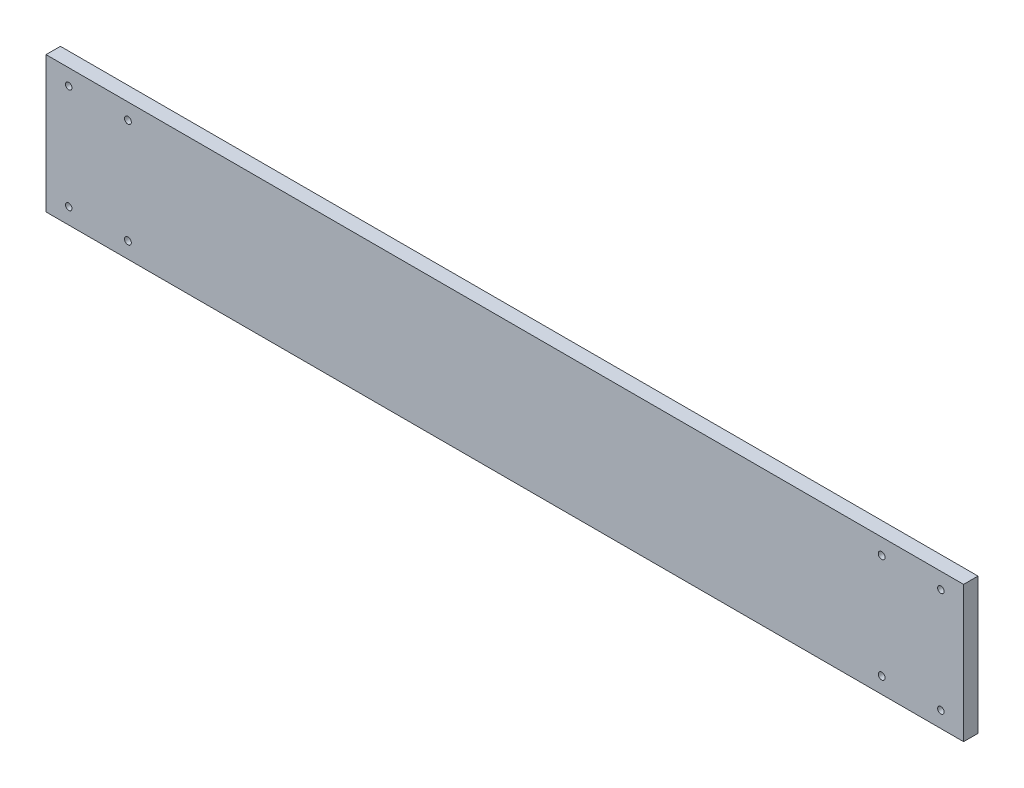
ISO-10303-21;
HEADER;
FILE_DESCRIPTION(('STEP AP214'),'2;1');
FILE_NAME('part.step','',(''),(''),'','','');
FILE_SCHEMA(('AUTOMOTIVE_DESIGN { 1 0 10303 214 1 1 1 1 }'));
ENDSEC;
DATA;
#1=APPLICATION_CONTEXT('core data for automotive mechanical design processes');
#2=APPLICATION_PROTOCOL_DEFINITION('international standard','automotive_design',2000,#1);
#3=PRODUCT_CONTEXT('',#1,'mechanical');
#4=PRODUCT('Part','Part','',(#3));
#5=PRODUCT_RELATED_PRODUCT_CATEGORY('part','',(#4));
#6=PRODUCT_DEFINITION_FORMATION('','',#4);
#7=PRODUCT_DEFINITION_CONTEXT('part definition',#1,'design');
#8=PRODUCT_DEFINITION('design','',#6,#7);
#9=PRODUCT_DEFINITION_SHAPE('','',#8);
#10=(LENGTH_UNIT() NAMED_UNIT(*) SI_UNIT(.MILLI.,.METRE.));
#11=(NAMED_UNIT(*) PLANE_ANGLE_UNIT() SI_UNIT($,.RADIAN.));
#12=(NAMED_UNIT(*) SI_UNIT($,.STERADIAN.) SOLID_ANGLE_UNIT());
#13=UNCERTAINTY_MEASURE_WITH_UNIT(LENGTH_MEASURE(1.E-05),#10,'distance_accuracy_value','');
#14=(GEOMETRIC_REPRESENTATION_CONTEXT(3) GLOBAL_UNCERTAINTY_ASSIGNED_CONTEXT((#13)) GLOBAL_UNIT_ASSIGNED_CONTEXT((#10,
#11,#12)) REPRESENTATION_CONTEXT('',''));
#15=CARTESIAN_POINT('',(0.,0.,0.));
#16=DIRECTION('',(0.,0.,1.));
#17=DIRECTION('',(1.,0.,0.));
#18=AXIS2_PLACEMENT_3D('',#15,#16,#17);
#19=CARTESIAN_POINT('',(-202.0250976,78.1484811081325,6.35));
#20=DIRECTION('',(1.,0.,0.));
#21=DIRECTION('',(0.,0.,-1.));
#22=AXIS2_PLACEMENT_3D('',#19,#20,#21);
#23=PLANE('',#22);
#24=DIRECTION('',(0.,-1.,0.));
#25=VECTOR('',#24,1.);
#26=CARTESIAN_POINT('',(-202.0250976,78.1484811081325,0.));
#27=LINE('',#26,#25);
#28=CARTESIAN_POINT('',(-202.0250976,78.1484811081325,0.));
#29=VERTEX_POINT('',#28);
#30=CARTESIAN_POINT('',(-202.0250976,18.1484811081324,0.));
#31=VERTEX_POINT('',#30);
#32=EDGE_CURVE('E113',#29,#31,#27,.T.);
#33=ORIENTED_EDGE('',*,*,#32,.T.);
#34=DIRECTION('',(0.,0.,-1.));
#35=VECTOR('',#34,1.);
#36=CARTESIAN_POINT('',(-202.0250976,18.1484811081324,6.35));
#37=LINE('',#36,#35);
#38=CARTESIAN_POINT('',(-202.0250976,18.1484811081324,6.35));
#39=VERTEX_POINT('',#38);
#40=EDGE_CURVE('E11',#39,#31,#37,.T.);
#41=ORIENTED_EDGE('',*,*,#40,.F.);
#42=DIRECTION('',(0.,-1.,0.));
#43=VECTOR('',#42,1.);
#44=CARTESIAN_POINT('',(-202.0250976,78.1484811081325,6.35));
#45=LINE('',#44,#43);
#46=CARTESIAN_POINT('',(-202.0250976,78.1484811081325,6.35));
#47=VERTEX_POINT('',#46);
#48=EDGE_CURVE('E96',#47,#39,#45,.T.);
#49=ORIENTED_EDGE('',*,*,#48,.F.);
#50=DIRECTION('',(0.,0.,-1.));
#51=VECTOR('',#50,1.);
#52=CARTESIAN_POINT('',(-202.0250976,78.1484811081325,6.35));
#53=LINE('',#52,#51);
#54=EDGE_CURVE('E109',#47,#29,#53,.T.);
#55=ORIENTED_EDGE('',*,*,#54,.T.);
#56=EDGE_LOOP('',(#33,#41,#49,#55));
#57=FACE_BOUND('',#56,.T.);
#58=ADVANCED_FACE('F38',(#57),#23,.F.);
#59=CARTESIAN_POINT('',(-202.0250976,18.1484811081324,6.35));
#60=DIRECTION('',(0.,1.,0.));
#61=DIRECTION('',(0.,0.,1.));
#62=AXIS2_PLACEMENT_3D('',#59,#60,#61);
#63=PLANE('',#62);
#64=DIRECTION('',(1.,0.,0.));
#65=VECTOR('',#64,1.);
#66=CARTESIAN_POINT('',(-202.0250976,18.1484811081324,0.));
#67=LINE('',#66,#65);
#68=CARTESIAN_POINT('',(202.0250976,18.1484811081324,0.));
#69=VERTEX_POINT('',#68);
#70=EDGE_CURVE('E101',#31,#69,#67,.T.);
#71=ORIENTED_EDGE('',*,*,#70,.T.);
#72=DIRECTION('',(0.,0.,-1.));
#73=VECTOR('',#72,1.);
#74=CARTESIAN_POINT('',(202.0250976,18.1484811081324,6.35));
#75=LINE('',#74,#73);
#76=CARTESIAN_POINT('',(202.0250976,18.1484811081324,6.35));
#77=VERTEX_POINT('',#76);
#78=EDGE_CURVE('E47',#77,#69,#75,.T.);
#79=ORIENTED_EDGE('',*,*,#78,.F.);
#80=DIRECTION('',(1.,0.,0.));
#81=VECTOR('',#80,1.);
#82=CARTESIAN_POINT('',(-202.0250976,18.1484811081324,6.35));
#83=LINE('',#82,#81);
#84=EDGE_CURVE('E91',#39,#77,#83,.T.);
#85=ORIENTED_EDGE('',*,*,#84,.F.);
#86=ORIENTED_EDGE('',*,*,#40,.T.);
#87=EDGE_LOOP('',(#71,#79,#85,#86));
#88=FACE_BOUND('',#87,.T.);
#89=ADVANCED_FACE('F100',(#88),#63,.F.);
#90=CARTESIAN_POINT('',(202.0250976,78.1484811081325,6.35));
#91=DIRECTION('',(-1.,0.,0.));
#92=DIRECTION('',(0.,0.,1.));
#93=AXIS2_PLACEMENT_3D('',#90,#91,#92);
#94=PLANE('',#93);
#95=DIRECTION('',(0.,1.,0.));
#96=VECTOR('',#95,1.);
#97=CARTESIAN_POINT('',(202.0250976,78.1484811081325,0.));
#98=LINE('',#97,#96);
#99=CARTESIAN_POINT('',(202.0250976,78.1484811081325,0.));
#100=VERTEX_POINT('',#99);
#101=EDGE_CURVE('E76',#69,#100,#98,.T.);
#102=ORIENTED_EDGE('',*,*,#101,.T.);
#103=DIRECTION('',(0.,0.,-1.));
#104=VECTOR('',#103,1.);
#105=CARTESIAN_POINT('',(202.0250976,78.1484811081325,6.35));
#106=LINE('',#105,#104);
#107=CARTESIAN_POINT('',(202.0250976,78.1484811081325,6.35));
#108=VERTEX_POINT('',#107);
#109=EDGE_CURVE('E103',#108,#100,#106,.T.);
#110=ORIENTED_EDGE('',*,*,#109,.F.);
#111=DIRECTION('',(0.,1.,0.));
#112=VECTOR('',#111,1.);
#113=CARTESIAN_POINT('',(202.0250976,78.1484811081325,6.35));
#114=LINE('',#113,#112);
#115=EDGE_CURVE('E94',#77,#108,#114,.T.);
#116=ORIENTED_EDGE('',*,*,#115,.F.);
#117=ORIENTED_EDGE('',*,*,#78,.T.);
#118=EDGE_LOOP('',(#102,#110,#116,#117));
#119=FACE_BOUND('',#118,.T.);
#120=ADVANCED_FACE('F104',(#119),#94,.F.);
#121=CARTESIAN_POINT('',(-202.0250976,78.1484811081325,6.35));
#122=DIRECTION('',(0.,-1.,0.));
#123=DIRECTION('',(0.,0.,-1.));
#124=AXIS2_PLACEMENT_3D('',#121,#122,#123);
#125=PLANE('',#124);
#126=DIRECTION('',(-1.,0.,0.));
#127=VECTOR('',#126,1.);
#128=CARTESIAN_POINT('',(-202.0250976,78.1484811081325,0.));
#129=LINE('',#128,#127);
#130=EDGE_CURVE('E84',#100,#29,#129,.T.);
#131=ORIENTED_EDGE('',*,*,#130,.T.);
#132=ORIENTED_EDGE('',*,*,#54,.F.);
#133=DIRECTION('',(-1.,0.,0.));
#134=VECTOR('',#133,1.);
#135=CARTESIAN_POINT('',(-202.0250976,78.1484811081325,6.35));
#136=LINE('',#135,#134);
#137=EDGE_CURVE('E55',#108,#47,#136,.T.);
#138=ORIENTED_EDGE('',*,*,#137,.F.);
#139=ORIENTED_EDGE('',*,*,#109,.T.);
#140=EDGE_LOOP('',(#131,#132,#138,#139));
#141=FACE_BOUND('',#140,.T.);
#142=ADVANCED_FACE('F127',(#141),#125,.F.);
#143=CARTESIAN_POINT('',(0.,0.,6.35));
#144=DIRECTION('',(0.,0.,1.));
#145=DIRECTION('',(1.,0.,0.));
#146=AXIS2_PLACEMENT_3D('',#143,#144,#145);
#147=PLANE('',#146);
#148=CARTESIAN_POINT('',(192.0250976,71.1484811081325,6.35));
#149=DIRECTION('',(0.,0.,1.));
#150=DIRECTION('',(1.,0.,0.));
#151=AXIS2_PLACEMENT_3D('',#148,#149,#150);
#152=CIRCLE('',#151,1.42500000000002);
#153=CARTESIAN_POINT('',(193.4500976,71.1484811081325,6.35));
#154=VERTEX_POINT('',#153);
#155=EDGE_CURVE('E158',#154,#154,#152,.T.);
#156=ORIENTED_EDGE('',*,*,#155,.F.);
#157=EDGE_LOOP('',(#156));
#158=FACE_BOUND('',#157,.T.);
#159=CARTESIAN_POINT('',(165.950402597568,71.1484811081323,6.35));
#160=DIRECTION('',(0.,0.,1.));
#161=DIRECTION('',(1.,0.,0.));
#162=AXIS2_PLACEMENT_3D('',#159,#160,#161);
#163=CIRCLE('',#162,1.50000000000014);
#164=CARTESIAN_POINT('',(167.450402597568,71.1484811081323,6.35));
#165=VERTEX_POINT('',#164);
#166=EDGE_CURVE('E166',#165,#165,#163,.T.);
#167=ORIENTED_EDGE('',*,*,#166,.F.);
#168=EDGE_LOOP('',(#167));
#169=FACE_BOUND('',#168,.T.);
#170=CARTESIAN_POINT('',(165.950402597568,25.1484811081324,6.35));
#171=DIRECTION('',(0.,0.,1.));
#172=DIRECTION('',(1.,0.,0.));
#173=AXIS2_PLACEMENT_3D('',#170,#171,#172);
#174=CIRCLE('',#173,1.5);
#175=CARTESIAN_POINT('',(167.450402597568,25.1484811081324,6.35));
#176=VERTEX_POINT('',#175);
#177=EDGE_CURVE('E142',#176,#176,#174,.T.);
#178=ORIENTED_EDGE('',*,*,#177,.F.);
#179=EDGE_LOOP('',(#178));
#180=FACE_BOUND('',#179,.T.);
#181=CARTESIAN_POINT('',(-165.950402597568,71.1484811081323,6.35));
#182=DIRECTION('',(0.,0.,1.));
#183=DIRECTION('',(1.,0.,0.));
#184=AXIS2_PLACEMENT_3D('',#181,#182,#183);
#185=CIRCLE('',#184,1.50000000000014);
#186=CARTESIAN_POINT('',(-164.450402597568,71.1484811081323,6.35));
#187=VERTEX_POINT('',#186);
#188=EDGE_CURVE('E151',#187,#187,#185,.T.);
#189=ORIENTED_EDGE('',*,*,#188,.F.);
#190=EDGE_LOOP('',(#189));
#191=FACE_BOUND('',#190,.T.);
#192=CARTESIAN_POINT('',(192.0250976,25.1484811081324,6.35));
#193=DIRECTION('',(0.,0.,1.));
#194=DIRECTION('',(-1.,0.,0.));
#195=AXIS2_PLACEMENT_3D('',#192,#193,#194);
#196=CIRCLE('',#195,1.42500000000002);
#197=CARTESIAN_POINT('',(190.6000976,25.1484811081324,6.35));
#198=VERTEX_POINT('',#197);
#199=EDGE_CURVE('E189',#198,#198,#196,.T.);
#200=ORIENTED_EDGE('',*,*,#199,.F.);
#201=EDGE_LOOP('',(#200));
#202=FACE_BOUND('',#201,.T.);
#203=CARTESIAN_POINT('',(-192.0250976,25.1484811081324,6.35));
#204=DIRECTION('',(0.,0.,1.));
#205=DIRECTION('',(1.,0.,0.));
#206=AXIS2_PLACEMENT_3D('',#203,#204,#205);
#207=CIRCLE('',#206,1.42500000000002);
#208=CARTESIAN_POINT('',(-190.6000976,25.1484811081324,6.35));
#209=VERTEX_POINT('',#208);
#210=EDGE_CURVE('E181',#209,#209,#207,.T.);
#211=ORIENTED_EDGE('',*,*,#210,.F.);
#212=EDGE_LOOP('',(#211));
#213=FACE_BOUND('',#212,.T.);
#214=CARTESIAN_POINT('',(-192.0250976,71.1484811081325,6.35));
#215=DIRECTION('',(0.,0.,1.));
#216=DIRECTION('',(-1.,0.,0.));
#217=AXIS2_PLACEMENT_3D('',#214,#215,#216);
#218=CIRCLE('',#217,1.42500000000002);
#219=CARTESIAN_POINT('',(-193.4500976,71.1484811081325,6.35));
#220=VERTEX_POINT('',#219);
#221=EDGE_CURVE('E173',#220,#220,#218,.T.);
#222=ORIENTED_EDGE('',*,*,#221,.F.);
#223=EDGE_LOOP('',(#222));
#224=FACE_BOUND('',#223,.T.);
#225=CARTESIAN_POINT('',(-165.950402597568,25.1484811081324,6.35));
#226=DIRECTION('',(0.,0.,1.));
#227=DIRECTION('',(1.,0.,0.));
#228=AXIS2_PLACEMENT_3D('',#225,#226,#227);
#229=CIRCLE('',#228,1.5);
#230=CARTESIAN_POINT('',(-164.450402597568,25.1484811081324,6.35));
#231=VERTEX_POINT('',#230);
#232=EDGE_CURVE('E135',#231,#231,#229,.T.);
#233=ORIENTED_EDGE('',*,*,#232,.F.);
#234=EDGE_LOOP('',(#233));
#235=FACE_BOUND('',#234,.T.);
#236=ORIENTED_EDGE('',*,*,#48,.T.);
#237=ORIENTED_EDGE('',*,*,#84,.T.);
#238=ORIENTED_EDGE('',*,*,#115,.T.);
#239=ORIENTED_EDGE('',*,*,#137,.T.);
#240=EDGE_LOOP('',(#236,#237,#238,#239));
#241=FACE_BOUND('',#240,.T.);
#242=ADVANCED_FACE('F92',(#158,#169,#180,#191,#202,#213,#224,#235,#241),#147,.T.);
#243=CARTESIAN_POINT('',(0.,0.,0.));
#244=DIRECTION('',(0.,0.,1.));
#245=DIRECTION('',(1.,0.,0.));
#246=AXIS2_PLACEMENT_3D('',#243,#244,#245);
#247=PLANE('',#246);
#248=CARTESIAN_POINT('',(192.0250976,71.1484811081325,0.));
#249=DIRECTION('',(0.,0.,1.));
#250=DIRECTION('',(1.,0.,0.));
#251=AXIS2_PLACEMENT_3D('',#248,#249,#250);
#252=CIRCLE('',#251,1.42500000000002);
#253=CARTESIAN_POINT('',(193.4500976,71.1484811081325,0.));
#254=VERTEX_POINT('',#253);
#255=EDGE_CURVE('E162',#254,#254,#252,.T.);
#256=ORIENTED_EDGE('',*,*,#255,.T.);
#257=EDGE_LOOP('',(#256));
#258=FACE_BOUND('',#257,.T.);
#259=CARTESIAN_POINT('',(165.950402597568,71.1484811081323,0.));
#260=DIRECTION('',(0.,0.,1.));
#261=DIRECTION('',(1.,0.,0.));
#262=AXIS2_PLACEMENT_3D('',#259,#260,#261);
#263=CIRCLE('',#262,1.50000000000014);
#264=CARTESIAN_POINT('',(167.450402597568,71.1484811081323,0.));
#265=VERTEX_POINT('',#264);
#266=EDGE_CURVE('E147',#265,#265,#263,.T.);
#267=ORIENTED_EDGE('',*,*,#266,.T.);
#268=EDGE_LOOP('',(#267));
#269=FACE_BOUND('',#268,.T.);
#270=CARTESIAN_POINT('',(165.950402597568,25.1484811081324,0.));
#271=DIRECTION('',(0.,0.,1.));
#272=DIRECTION('',(1.,0.,0.));
#273=AXIS2_PLACEMENT_3D('',#270,#271,#272);
#274=CIRCLE('',#273,1.5);
#275=CARTESIAN_POINT('',(167.450402597568,25.1484811081324,0.));
#276=VERTEX_POINT('',#275);
#277=EDGE_CURVE('E146',#276,#276,#274,.T.);
#278=ORIENTED_EDGE('',*,*,#277,.T.);
#279=EDGE_LOOP('',(#278));
#280=FACE_BOUND('',#279,.T.);
#281=CARTESIAN_POINT('',(-165.950402597568,71.1484811081323,0.));
#282=DIRECTION('',(0.,0.,1.));
#283=DIRECTION('',(1.,0.,0.));
#284=AXIS2_PLACEMENT_3D('',#281,#282,#283);
#285=CIRCLE('',#284,1.50000000000014);
#286=CARTESIAN_POINT('',(-164.450402597568,71.1484811081323,0.));
#287=VERTEX_POINT('',#286);
#288=EDGE_CURVE('E138',#287,#287,#285,.T.);
#289=ORIENTED_EDGE('',*,*,#288,.T.);
#290=EDGE_LOOP('',(#289));
#291=FACE_BOUND('',#290,.T.);
#292=CARTESIAN_POINT('',(192.0250976,25.1484811081324,0.));
#293=DIRECTION('',(0.,0.,1.));
#294=DIRECTION('',(-1.,0.,0.));
#295=AXIS2_PLACEMENT_3D('',#292,#293,#294);
#296=CIRCLE('',#295,1.42500000000002);
#297=CARTESIAN_POINT('',(190.6000976,25.1484811081324,0.));
#298=VERTEX_POINT('',#297);
#299=EDGE_CURVE('E163',#298,#298,#296,.T.);
#300=ORIENTED_EDGE('',*,*,#299,.T.);
#301=EDGE_LOOP('',(#300));
#302=FACE_BOUND('',#301,.T.);
#303=CARTESIAN_POINT('',(-192.0250976,25.1484811081324,0.));
#304=DIRECTION('',(0.,0.,1.));
#305=DIRECTION('',(1.,0.,0.));
#306=AXIS2_PLACEMENT_3D('',#303,#304,#305);
#307=CIRCLE('',#306,1.42500000000002);
#308=CARTESIAN_POINT('',(-190.6000976,25.1484811081324,0.));
#309=VERTEX_POINT('',#308);
#310=EDGE_CURVE('E185',#309,#309,#307,.T.);
#311=ORIENTED_EDGE('',*,*,#310,.T.);
#312=EDGE_LOOP('',(#311));
#313=FACE_BOUND('',#312,.T.);
#314=CARTESIAN_POINT('',(-192.0250976,71.1484811081325,0.));
#315=DIRECTION('',(0.,0.,1.));
#316=DIRECTION('',(-1.,0.,0.));
#317=AXIS2_PLACEMENT_3D('',#314,#315,#316);
#318=CIRCLE('',#317,1.42500000000002);
#319=CARTESIAN_POINT('',(-193.4500976,71.1484811081325,0.));
#320=VERTEX_POINT('',#319);
#321=EDGE_CURVE('E177',#320,#320,#318,.T.);
#322=ORIENTED_EDGE('',*,*,#321,.T.);
#323=EDGE_LOOP('',(#322));
#324=FACE_BOUND('',#323,.T.);
#325=CARTESIAN_POINT('',(-165.950402597568,25.1484811081324,0.));
#326=DIRECTION('',(0.,0.,1.));
#327=DIRECTION('',(1.,0.,0.));
#328=AXIS2_PLACEMENT_3D('',#325,#326,#327);
#329=CIRCLE('',#328,1.5);
#330=CARTESIAN_POINT('',(-164.450402597568,25.1484811081324,0.));
#331=VERTEX_POINT('',#330);
#332=EDGE_CURVE('E117',#331,#331,#329,.T.);
#333=ORIENTED_EDGE('',*,*,#332,.T.);
#334=EDGE_LOOP('',(#333));
#335=FACE_BOUND('',#334,.T.);
#336=ORIENTED_EDGE('',*,*,#32,.F.);
#337=ORIENTED_EDGE('',*,*,#130,.F.);
#338=ORIENTED_EDGE('',*,*,#101,.F.);
#339=ORIENTED_EDGE('',*,*,#70,.F.);
#340=EDGE_LOOP('',(#336,#337,#338,#339));
#341=FACE_BOUND('',#340,.T.);
#342=ADVANCED_FACE('F130',(#258,#269,#280,#291,#302,#313,#324,#335,#341),#247,.F.);
#343=CARTESIAN_POINT('',(-165.950402597568,25.1484811081324,0.));
#344=DIRECTION('',(0.,0.,1.));
#345=DIRECTION('',(1.,0.,0.));
#346=AXIS2_PLACEMENT_3D('',#343,#344,#345);
#347=CYLINDRICAL_SURFACE('',#346,1.5);
#348=ORIENTED_EDGE('',*,*,#332,.F.);
#349=EDGE_LOOP('',(#348));
#350=FACE_BOUND('',#349,.T.);
#351=ORIENTED_EDGE('',*,*,#232,.T.);
#352=EDGE_LOOP('',(#351));
#353=FACE_BOUND('',#352,.T.);
#354=ADVANCED_FACE('F217',(#350,#353),#347,.F.);
#355=CARTESIAN_POINT('',(-192.0250976,71.1484811081325,0.));
#356=DIRECTION('',(0.,0.,1.));
#357=DIRECTION('',(1.,0.,0.));
#358=AXIS2_PLACEMENT_3D('',#355,#356,#357);
#359=CYLINDRICAL_SURFACE('',#358,1.42500000000002);
#360=ORIENTED_EDGE('',*,*,#321,.F.);
#361=EDGE_LOOP('',(#360));
#362=FACE_BOUND('',#361,.T.);
#363=ORIENTED_EDGE('',*,*,#221,.T.);
#364=EDGE_LOOP('',(#363));
#365=FACE_BOUND('',#364,.T.);
#366=ADVANCED_FACE('F219',(#362,#365),#359,.F.);
#367=CARTESIAN_POINT('',(-192.0250976,25.1484811081324,0.));
#368=DIRECTION('',(0.,0.,1.));
#369=DIRECTION('',(1.,0.,0.));
#370=AXIS2_PLACEMENT_3D('',#367,#368,#369);
#371=CYLINDRICAL_SURFACE('',#370,1.42500000000002);
#372=ORIENTED_EDGE('',*,*,#310,.F.);
#373=EDGE_LOOP('',(#372));
#374=FACE_BOUND('',#373,.T.);
#375=ORIENTED_EDGE('',*,*,#210,.T.);
#376=EDGE_LOOP('',(#375));
#377=FACE_BOUND('',#376,.T.);
#378=ADVANCED_FACE('F203',(#374,#377),#371,.F.);
#379=CARTESIAN_POINT('',(192.0250976,25.1484811081324,0.));
#380=DIRECTION('',(0.,0.,1.));
#381=DIRECTION('',(1.,0.,0.));
#382=AXIS2_PLACEMENT_3D('',#379,#380,#381);
#383=CYLINDRICAL_SURFACE('',#382,1.42500000000002);
#384=ORIENTED_EDGE('',*,*,#299,.F.);
#385=EDGE_LOOP('',(#384));
#386=FACE_BOUND('',#385,.T.);
#387=ORIENTED_EDGE('',*,*,#199,.T.);
#388=EDGE_LOOP('',(#387));
#389=FACE_BOUND('',#388,.T.);
#390=ADVANCED_FACE('F199',(#386,#389),#383,.F.);
#391=CARTESIAN_POINT('',(-165.950402597568,71.1484811081323,0.));
#392=DIRECTION('',(0.,0.,1.));
#393=DIRECTION('',(1.,0.,0.));
#394=AXIS2_PLACEMENT_3D('',#391,#392,#393);
#395=CYLINDRICAL_SURFACE('',#394,1.50000000000014);
#396=ORIENTED_EDGE('',*,*,#288,.F.);
#397=EDGE_LOOP('',(#396));
#398=FACE_BOUND('',#397,.T.);
#399=ORIENTED_EDGE('',*,*,#188,.T.);
#400=EDGE_LOOP('',(#399));
#401=FACE_BOUND('',#400,.T.);
#402=ADVANCED_FACE('F202',(#398,#401),#395,.F.);
#403=CARTESIAN_POINT('',(165.950402597568,25.1484811081324,0.));
#404=DIRECTION('',(0.,0.,1.));
#405=DIRECTION('',(1.,0.,0.));
#406=AXIS2_PLACEMENT_3D('',#403,#404,#405);
#407=CYLINDRICAL_SURFACE('',#406,1.5);
#408=ORIENTED_EDGE('',*,*,#277,.F.);
#409=EDGE_LOOP('',(#408));
#410=FACE_BOUND('',#409,.T.);
#411=ORIENTED_EDGE('',*,*,#177,.T.);
#412=EDGE_LOOP('',(#411));
#413=FACE_BOUND('',#412,.T.);
#414=ADVANCED_FACE('F291',(#410,#413),#407,.F.);
#415=CARTESIAN_POINT('',(165.950402597568,71.1484811081323,0.));
#416=DIRECTION('',(0.,0.,1.));
#417=DIRECTION('',(1.,0.,0.));
#418=AXIS2_PLACEMENT_3D('',#415,#416,#417);
#419=CYLINDRICAL_SURFACE('',#418,1.50000000000014);
#420=ORIENTED_EDGE('',*,*,#266,.F.);
#421=EDGE_LOOP('',(#420));
#422=FACE_BOUND('',#421,.T.);
#423=ORIENTED_EDGE('',*,*,#166,.T.);
#424=EDGE_LOOP('',(#423));
#425=FACE_BOUND('',#424,.T.);
#426=ADVANCED_FACE('F301',(#422,#425),#419,.F.);
#427=CARTESIAN_POINT('',(192.0250976,71.1484811081325,0.));
#428=DIRECTION('',(0.,0.,1.));
#429=DIRECTION('',(1.,0.,0.));
#430=AXIS2_PLACEMENT_3D('',#427,#428,#429);
#431=CYLINDRICAL_SURFACE('',#430,1.42500000000002);
#432=ORIENTED_EDGE('',*,*,#255,.F.);
#433=EDGE_LOOP('',(#432));
#434=FACE_BOUND('',#433,.T.);
#435=ORIENTED_EDGE('',*,*,#155,.T.);
#436=EDGE_LOOP('',(#435));
#437=FACE_BOUND('',#436,.T.);
#438=ADVANCED_FACE('F310',(#434,#437),#431,.F.);
#439=CLOSED_SHELL('',(#58,#89,#120,#142,#242,#342,#354,#366,#378,#390,#402,#414,#426,#438));
#440=MANIFOLD_SOLID_BREP('B2',#439);
#441=ADVANCED_BREP_SHAPE_REPRESENTATION('',(#18,#440),#14);
#442=SHAPE_DEFINITION_REPRESENTATION(#9,#441);
ENDSEC;
END-ISO-10303-21;
